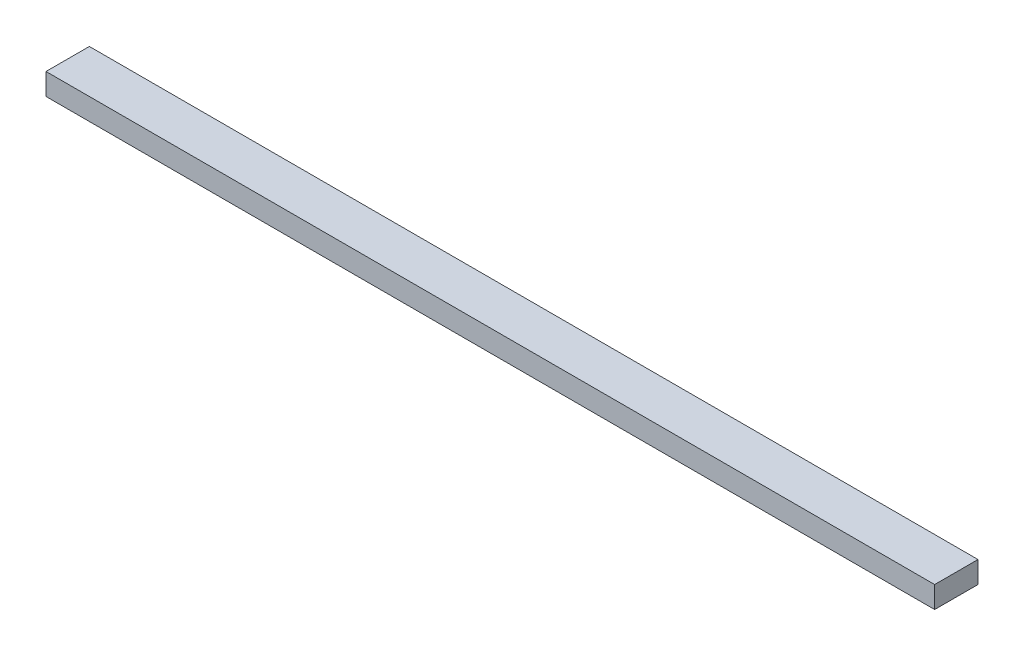
ISO-10303-21;
HEADER;
FILE_DESCRIPTION(('STEP AP214'),'2;1');
FILE_NAME('part.step','',(''),(''),'','','');
FILE_SCHEMA(('AUTOMOTIVE_DESIGN { 1 0 10303 214 1 1 1 1 }'));
ENDSEC;
DATA;
#1=APPLICATION_CONTEXT('core data for automotive mechanical design processes');
#2=APPLICATION_PROTOCOL_DEFINITION('international standard','automotive_design',2000,#1);
#3=PRODUCT_CONTEXT('',#1,'mechanical');
#4=PRODUCT('Part','Part','',(#3));
#5=PRODUCT_RELATED_PRODUCT_CATEGORY('part','',(#4));
#6=PRODUCT_DEFINITION_FORMATION('','',#4);
#7=PRODUCT_DEFINITION_CONTEXT('part definition',#1,'design');
#8=PRODUCT_DEFINITION('design','',#6,#7);
#9=PRODUCT_DEFINITION_SHAPE('','',#8);
#10=(LENGTH_UNIT() NAMED_UNIT(*) SI_UNIT(.MILLI.,.METRE.));
#11=(NAMED_UNIT(*) PLANE_ANGLE_UNIT() SI_UNIT($,.RADIAN.));
#12=(NAMED_UNIT(*) SI_UNIT($,.STERADIAN.) SOLID_ANGLE_UNIT());
#13=UNCERTAINTY_MEASURE_WITH_UNIT(LENGTH_MEASURE(1.E-05),#10,'distance_accuracy_value','');
#14=(GEOMETRIC_REPRESENTATION_CONTEXT(3) GLOBAL_UNCERTAINTY_ASSIGNED_CONTEXT((#13)) GLOBAL_UNIT_ASSIGNED_CONTEXT((#10,
#11,#12)) REPRESENTATION_CONTEXT('',''));
#15=CARTESIAN_POINT('',(0.,0.,0.));
#16=DIRECTION('',(0.,0.,1.));
#17=DIRECTION('',(1.,0.,0.));
#18=AXIS2_PLACEMENT_3D('',#15,#16,#17);
#19=CARTESIAN_POINT('',(-205.,10.,-9.99999999999998));
#20=DIRECTION('',(1.,0.,0.));
#21=DIRECTION('',(0.,0.,-1.));
#22=AXIS2_PLACEMENT_3D('',#19,#20,#21);
#23=PLANE('',#22);
#24=DIRECTION('',(0.,0.,1.));
#25=VECTOR('',#24,1.);
#26=CARTESIAN_POINT('',(-205.,0.,-9.99999999999998));
#27=LINE('',#26,#25);
#28=CARTESIAN_POINT('',(-205.,0.,-9.99999999999998));
#29=VERTEX_POINT('',#28);
#30=CARTESIAN_POINT('',(-205.,0.,10.));
#31=VERTEX_POINT('',#30);
#32=EDGE_CURVE('E97',#29,#31,#27,.T.);
#33=ORIENTED_EDGE('',*,*,#32,.T.);
#34=DIRECTION('',(0.,-1.,0.));
#35=VECTOR('',#34,1.);
#36=CARTESIAN_POINT('',(-205.,10.,10.));
#37=LINE('',#36,#35);
#38=CARTESIAN_POINT('',(-205.,10.,10.));
#39=VERTEX_POINT('',#38);
#40=EDGE_CURVE('E11',#39,#31,#37,.T.);
#41=ORIENTED_EDGE('',*,*,#40,.F.);
#42=DIRECTION('',(0.,0.,1.));
#43=VECTOR('',#42,1.);
#44=CARTESIAN_POINT('',(-205.,10.,-9.99999999999998));
#45=LINE('',#44,#43);
#46=CARTESIAN_POINT('',(-205.,10.,-9.99999999999998));
#47=VERTEX_POINT('',#46);
#48=EDGE_CURVE('E85',#47,#39,#45,.T.);
#49=ORIENTED_EDGE('',*,*,#48,.F.);
#50=DIRECTION('',(0.,-1.,0.));
#51=VECTOR('',#50,1.);
#52=CARTESIAN_POINT('',(-205.,10.,-9.99999999999998));
#53=LINE('',#52,#51);
#54=EDGE_CURVE('E93',#47,#29,#53,.T.);
#55=ORIENTED_EDGE('',*,*,#54,.T.);
#56=EDGE_LOOP('',(#33,#41,#49,#55));
#57=FACE_BOUND('',#56,.T.);
#58=ADVANCED_FACE('F34',(#57),#23,.F.);
#59=CARTESIAN_POINT('',(-205.,10.,10.));
#60=DIRECTION('',(0.,0.,-1.));
#61=DIRECTION('',(-1.,0.,0.));
#62=AXIS2_PLACEMENT_3D('',#59,#60,#61);
#63=PLANE('',#62);
#64=DIRECTION('',(1.,0.,0.));
#65=VECTOR('',#64,1.);
#66=CARTESIAN_POINT('',(-205.,0.,10.));
#67=LINE('',#66,#65);
#68=CARTESIAN_POINT('',(205.,0.,10.));
#69=VERTEX_POINT('',#68);
#70=EDGE_CURVE('E89',#31,#69,#67,.T.);
#71=ORIENTED_EDGE('',*,*,#70,.T.);
#72=DIRECTION('',(0.,-1.,0.));
#73=VECTOR('',#72,1.);
#74=CARTESIAN_POINT('',(205.,10.,10.));
#75=LINE('',#74,#73);
#76=CARTESIAN_POINT('',(205.,10.,10.));
#77=VERTEX_POINT('',#76);
#78=EDGE_CURVE('E42',#77,#69,#75,.T.);
#79=ORIENTED_EDGE('',*,*,#78,.F.);
#80=DIRECTION('',(1.,0.,0.));
#81=VECTOR('',#80,1.);
#82=CARTESIAN_POINT('',(-205.,10.,10.));
#83=LINE('',#82,#81);
#84=EDGE_CURVE('E80',#39,#77,#83,.T.);
#85=ORIENTED_EDGE('',*,*,#84,.F.);
#86=ORIENTED_EDGE('',*,*,#40,.T.);
#87=EDGE_LOOP('',(#71,#79,#85,#86));
#88=FACE_BOUND('',#87,.T.);
#89=ADVANCED_FACE('F88',(#88),#63,.F.);
#90=CARTESIAN_POINT('',(205.,10.,-9.99999999999998));
#91=DIRECTION('',(-1.,0.,0.));
#92=DIRECTION('',(0.,0.,1.));
#93=AXIS2_PLACEMENT_3D('',#90,#91,#92);
#94=PLANE('',#93);
#95=DIRECTION('',(0.,0.,-1.));
#96=VECTOR('',#95,1.);
#97=CARTESIAN_POINT('',(205.,0.,-9.99999999999998));
#98=LINE('',#97,#96);
#99=CARTESIAN_POINT('',(205.,0.,-9.99999999999998));
#100=VERTEX_POINT('',#99);
#101=EDGE_CURVE('E67',#69,#100,#98,.T.);
#102=ORIENTED_EDGE('',*,*,#101,.T.);
#103=DIRECTION('',(0.,-1.,0.));
#104=VECTOR('',#103,1.);
#105=CARTESIAN_POINT('',(205.,10.,-9.99999999999998));
#106=LINE('',#105,#104);
#107=CARTESIAN_POINT('',(205.,10.,-9.99999999999998));
#108=VERTEX_POINT('',#107);
#109=EDGE_CURVE('E90',#108,#100,#106,.T.);
#110=ORIENTED_EDGE('',*,*,#109,.F.);
#111=DIRECTION('',(0.,0.,-1.));
#112=VECTOR('',#111,1.);
#113=CARTESIAN_POINT('',(205.,10.,-9.99999999999998));
#114=LINE('',#113,#112);
#115=EDGE_CURVE('E83',#77,#108,#114,.T.);
#116=ORIENTED_EDGE('',*,*,#115,.F.);
#117=ORIENTED_EDGE('',*,*,#78,.T.);
#118=EDGE_LOOP('',(#102,#110,#116,#117));
#119=FACE_BOUND('',#118,.T.);
#120=ADVANCED_FACE('F91',(#119),#94,.F.);
#121=CARTESIAN_POINT('',(-205.,10.,-9.99999999999998));
#122=DIRECTION('',(0.,0.,1.));
#123=DIRECTION('',(1.,0.,0.));
#124=AXIS2_PLACEMENT_3D('',#121,#122,#123);
#125=PLANE('',#124);
#126=DIRECTION('',(-1.,0.,0.));
#127=VECTOR('',#126,1.);
#128=CARTESIAN_POINT('',(-205.,0.,-9.99999999999998));
#129=LINE('',#128,#127);
#130=EDGE_CURVE('E73',#100,#29,#129,.T.);
#131=ORIENTED_EDGE('',*,*,#130,.T.);
#132=ORIENTED_EDGE('',*,*,#54,.F.);
#133=DIRECTION('',(-1.,0.,0.));
#134=VECTOR('',#133,1.);
#135=CARTESIAN_POINT('',(-205.,10.,-9.99999999999998));
#136=LINE('',#135,#134);
#137=EDGE_CURVE('E50',#108,#47,#136,.T.);
#138=ORIENTED_EDGE('',*,*,#137,.F.);
#139=ORIENTED_EDGE('',*,*,#109,.T.);
#140=EDGE_LOOP('',(#131,#132,#138,#139));
#141=FACE_BOUND('',#140,.T.);
#142=ADVANCED_FACE('F104',(#141),#125,.F.);
#143=CARTESIAN_POINT('',(0.,10.,0.));
#144=DIRECTION('',(0.,1.,0.));
#145=DIRECTION('',(0.,0.,1.));
#146=AXIS2_PLACEMENT_3D('',#143,#144,#145);
#147=PLANE('',#146);
#148=ORIENTED_EDGE('',*,*,#48,.T.);
#149=ORIENTED_EDGE('',*,*,#84,.T.);
#150=ORIENTED_EDGE('',*,*,#115,.T.);
#151=ORIENTED_EDGE('',*,*,#137,.T.);
#152=EDGE_LOOP('',(#148,#149,#150,#151));
#153=FACE_BOUND('',#152,.T.);
#154=ADVANCED_FACE('F81',(#153),#147,.T.);
#155=CARTESIAN_POINT('',(0.,0.,0.));
#156=DIRECTION('',(0.,1.,0.));
#157=DIRECTION('',(0.,0.,1.));
#158=AXIS2_PLACEMENT_3D('',#155,#156,#157);
#159=PLANE('',#158);
#160=ORIENTED_EDGE('',*,*,#32,.F.);
#161=ORIENTED_EDGE('',*,*,#130,.F.);
#162=ORIENTED_EDGE('',*,*,#101,.F.);
#163=ORIENTED_EDGE('',*,*,#70,.F.);
#164=EDGE_LOOP('',(#160,#161,#162,#163));
#165=FACE_BOUND('',#164,.T.);
#166=ADVANCED_FACE('F107',(#165),#159,.F.);
#167=CLOSED_SHELL('',(#58,#89,#120,#142,#154,#166));
#168=MANIFOLD_SOLID_BREP('B2',#167);
#169=ADVANCED_BREP_SHAPE_REPRESENTATION('',(#18,#168),#14);
#170=SHAPE_DEFINITION_REPRESENTATION(#9,#169);
ENDSEC;
END-ISO-10303-21;
